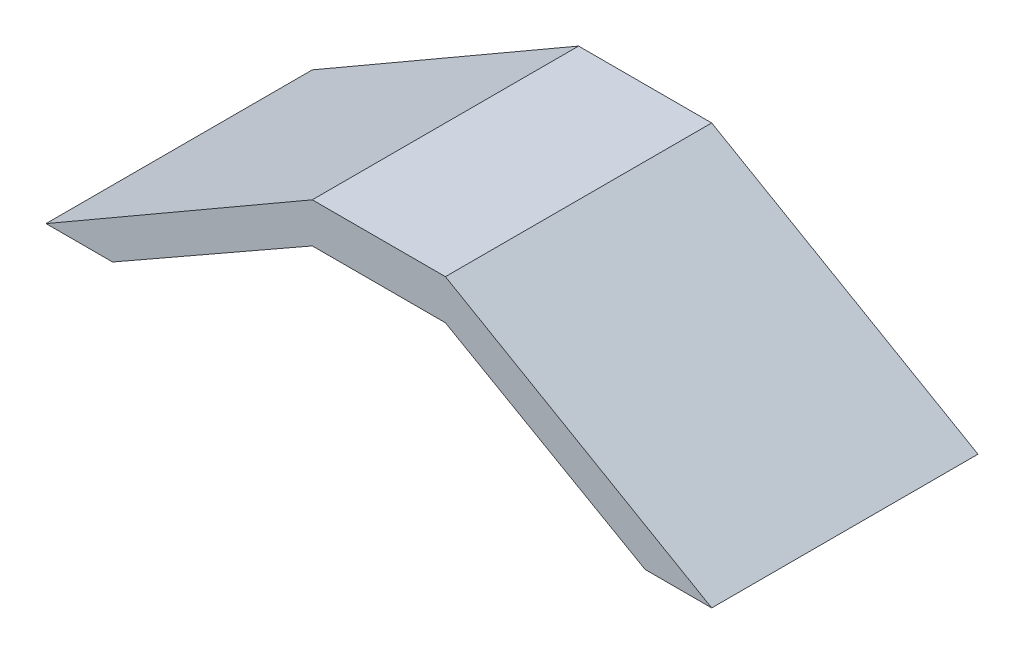
ISO-10303-21;
HEADER;
FILE_DESCRIPTION(('STEP AP214'),'2;1');
FILE_NAME('part.step','',(''),(''),'','','');
FILE_SCHEMA(('AUTOMOTIVE_DESIGN { 1 0 10303 214 1 1 1 1 }'));
ENDSEC;
DATA;
#1=APPLICATION_CONTEXT('core data for automotive mechanical design processes');
#2=APPLICATION_PROTOCOL_DEFINITION('international standard','automotive_design',2000,#1);
#3=PRODUCT_CONTEXT('',#1,'mechanical');
#4=PRODUCT('Part','Part','',(#3));
#5=PRODUCT_RELATED_PRODUCT_CATEGORY('part','',(#4));
#6=PRODUCT_DEFINITION_FORMATION('','',#4);
#7=PRODUCT_DEFINITION_CONTEXT('part definition',#1,'design');
#8=PRODUCT_DEFINITION('design','',#6,#7);
#9=PRODUCT_DEFINITION_SHAPE('','',#8);
#10=(LENGTH_UNIT() NAMED_UNIT(*) SI_UNIT(.MILLI.,.METRE.));
#11=(NAMED_UNIT(*) PLANE_ANGLE_UNIT() SI_UNIT($,.RADIAN.));
#12=(NAMED_UNIT(*) SI_UNIT($,.STERADIAN.) SOLID_ANGLE_UNIT());
#13=UNCERTAINTY_MEASURE_WITH_UNIT(LENGTH_MEASURE(1.E-05),#10,'distance_accuracy_value','');
#14=(GEOMETRIC_REPRESENTATION_CONTEXT(3) GLOBAL_UNCERTAINTY_ASSIGNED_CONTEXT((#13)) GLOBAL_UNIT_ASSIGNED_CONTEXT((#10,
#11,#12)) REPRESENTATION_CONTEXT('',''));
#15=CARTESIAN_POINT('',(0.,0.,0.));
#16=DIRECTION('',(0.,0.,1.));
#17=DIRECTION('',(1.,0.,0.));
#18=AXIS2_PLACEMENT_3D('',#15,#16,#17);
#19=CARTESIAN_POINT('',(0.,0.,-2000.));
#20=DIRECTION('',(0.,1.,0.));
#21=DIRECTION('',(-1.,0.,0.));
#22=AXIS2_PLACEMENT_3D('',#19,#20,#21);
#23=PLANE('',#22);
#24=DIRECTION('',(-1.,0.,0.));
#25=VECTOR('',#24,1.);
#26=CARTESIAN_POINT('',(0.,0.,0.));
#27=LINE('',#26,#25);
#28=CARTESIAN_POINT('',(-2500.,6.87163088490546E-13,0.));
#29=VERTEX_POINT('',#28);
#30=CARTESIAN_POINT('',(-3000.,8.49830834647197E-13,0.));
#31=VERTEX_POINT('',#30);
#32=EDGE_CURVE('E130',#29,#31,#27,.T.);
#33=ORIENTED_EDGE('',*,*,#32,.T.);
#34=DIRECTION('',(0.,0.,1.));
#35=VECTOR('',#34,1.);
#36=CARTESIAN_POINT('',(-3000.,8.49830834647197E-13,-2000.));
#37=LINE('',#36,#35);
#38=CARTESIAN_POINT('',(-3000.,8.49830834647197E-13,-2000.));
#39=VERTEX_POINT('',#38);
#40=EDGE_CURVE('E11',#39,#31,#37,.T.);
#41=ORIENTED_EDGE('',*,*,#40,.F.);
#42=DIRECTION('',(-1.,0.,0.));
#43=VECTOR('',#42,1.);
#44=CARTESIAN_POINT('',(0.,0.,-2000.));
#45=LINE('',#44,#43);
#46=CARTESIAN_POINT('',(-2500.,6.87163088490546E-13,-2000.));
#47=VERTEX_POINT('',#46);
#48=EDGE_CURVE('E148',#47,#39,#45,.T.);
#49=ORIENTED_EDGE('',*,*,#48,.F.);
#50=DIRECTION('',(0.,0.,1.));
#51=VECTOR('',#50,1.);
#52=CARTESIAN_POINT('',(-2500.,6.87163088490546E-13,-2000.));
#53=LINE('',#52,#51);
#54=EDGE_CURVE('E36',#47,#29,#53,.T.);
#55=ORIENTED_EDGE('',*,*,#54,.T.);
#56=EDGE_LOOP('',(#33,#41,#49,#55));
#57=FACE_BOUND('',#56,.T.);
#58=ADVANCED_FACE('F33',(#57),#23,.F.);
#59=CARTESIAN_POINT('',(-749.999999999984,1299.03810567665,-2000.));
#60=DIRECTION('',(0.499999999999995,-0.866025403784442,0.));
#61=DIRECTION('',(0.866025403784442,0.499999999999995,0.));
#62=AXIS2_PLACEMENT_3D('',#59,#60,#61);
#63=PLANE('',#62);
#64=DIRECTION('',(0.866025403784442,0.499999999999995,0.));
#65=VECTOR('',#64,1.);
#66=CARTESIAN_POINT('',(-749.999999999984,1299.03810567665,0.));
#67=LINE('',#66,#65);
#68=CARTESIAN_POINT('',(-1000.,1154.70053837923,0.));
#69=VERTEX_POINT('',#68);
#70=EDGE_CURVE('E84',#31,#69,#67,.T.);
#71=ORIENTED_EDGE('',*,*,#70,.T.);
#72=DIRECTION('',(0.,0.,1.));
#73=VECTOR('',#72,1.);
#74=CARTESIAN_POINT('',(-1000.,1154.70053837923,-2000.));
#75=LINE('',#74,#73);
#76=CARTESIAN_POINT('',(-1000.,1154.70053837923,-2000.));
#77=VERTEX_POINT('',#76);
#78=EDGE_CURVE('E42',#77,#69,#75,.T.);
#79=ORIENTED_EDGE('',*,*,#78,.F.);
#80=DIRECTION('',(0.866025403784442,0.499999999999995,0.));
#81=VECTOR('',#80,1.);
#82=CARTESIAN_POINT('',(-749.999999999984,1299.03810567665,-2000.));
#83=LINE('',#82,#81);
#84=EDGE_CURVE('E50',#39,#77,#83,.T.);
#85=ORIENTED_EDGE('',*,*,#84,.F.);
#86=ORIENTED_EDGE('',*,*,#40,.T.);
#87=EDGE_LOOP('',(#71,#79,#85,#86));
#88=FACE_BOUND('',#87,.T.);
#89=ADVANCED_FACE('F173',(#88),#63,.F.);
#90=CARTESIAN_POINT('',(-7.69185074553415E-13,1154.70053837924,-2000.));
#91=DIRECTION('',(0.,1.,0.));
#92=DIRECTION('',(-1.,0.,0.));
#93=AXIS2_PLACEMENT_3D('',#90,#91,#92);
#94=PLANE('',#93);
#95=DIRECTION('',(-1.,0.,0.));
#96=VECTOR('',#95,1.);
#97=CARTESIAN_POINT('',(-7.69185074553415E-13,1154.70053837924,0.));
#98=LINE('',#97,#96);
#99=CARTESIAN_POINT('',(0.,1154.70053837924,0.));
#100=VERTEX_POINT('',#99);
#101=EDGE_CURVE('E108',#100,#69,#98,.T.);
#102=ORIENTED_EDGE('',*,*,#101,.F.);
#103=DIRECTION('',(0.,0.,1.));
#104=VECTOR('',#103,1.);
#105=CARTESIAN_POINT('',(0.,1154.70053837924,-2000.));
#106=LINE('',#105,#104);
#107=CARTESIAN_POINT('',(0.,1154.70053837924,-2000.));
#108=VERTEX_POINT('',#107);
#109=EDGE_CURVE('E104',#108,#100,#106,.T.);
#110=ORIENTED_EDGE('',*,*,#109,.F.);
#111=DIRECTION('',(-1.,0.,0.));
#112=VECTOR('',#111,1.);
#113=CARTESIAN_POINT('',(-7.69185074553415E-13,1154.70053837924,-2000.));
#114=LINE('',#113,#112);
#115=EDGE_CURVE('E107',#108,#77,#114,.T.);
#116=ORIENTED_EDGE('',*,*,#115,.T.);
#117=ORIENTED_EDGE('',*,*,#78,.T.);
#118=EDGE_LOOP('',(#102,#110,#116,#117));
#119=FACE_BOUND('',#118,.T.);
#120=ADVANCED_FACE('F106',(#119),#94,.T.);
#121=CARTESIAN_POINT('',(499.99999999999,866.025403784433,-2000.));
#122=DIRECTION('',(0.499999999999995,0.866025403784442,0.));
#123=DIRECTION('',(-0.866025403784442,0.499999999999995,0.));
#124=AXIS2_PLACEMENT_3D('',#121,#122,#123);
#125=PLANE('',#124);
#126=DIRECTION('',(-0.866025403784442,0.499999999999995,0.));
#127=VECTOR('',#126,1.);
#128=CARTESIAN_POINT('',(499.99999999999,866.025403784433,0.));
#129=LINE('',#128,#127);
#130=CARTESIAN_POINT('',(2000.,0.,0.));
#131=VERTEX_POINT('',#130);
#132=EDGE_CURVE('E145',#131,#100,#129,.T.);
#133=ORIENTED_EDGE('',*,*,#132,.F.);
#134=DIRECTION('',(0.,0.,1.));
#135=VECTOR('',#134,1.);
#136=CARTESIAN_POINT('',(2000.,0.,-2000.));
#137=LINE('',#136,#135);
#138=CARTESIAN_POINT('',(2000.,0.,-2000.));
#139=VERTEX_POINT('',#138);
#140=EDGE_CURVE('E113',#139,#131,#137,.T.);
#141=ORIENTED_EDGE('',*,*,#140,.F.);
#142=DIRECTION('',(-0.866025403784442,0.499999999999995,0.));
#143=VECTOR('',#142,1.);
#144=CARTESIAN_POINT('',(499.99999999999,866.025403784433,-2000.));
#145=LINE('',#144,#143);
#146=EDGE_CURVE('E119',#139,#108,#145,.T.);
#147=ORIENTED_EDGE('',*,*,#146,.T.);
#148=ORIENTED_EDGE('',*,*,#109,.T.);
#149=EDGE_LOOP('',(#133,#141,#147,#148));
#150=FACE_BOUND('',#149,.T.);
#151=ADVANCED_FACE('F122',(#150),#125,.T.);
#152=CARTESIAN_POINT('',(0.,0.,-2000.));
#153=DIRECTION('',(0.,-1.,0.));
#154=DIRECTION('',(0.,0.,-1.));
#155=AXIS2_PLACEMENT_3D('',#152,#153,#154);
#156=PLANE('',#155);
#157=DIRECTION('',(1.,0.,0.));
#158=VECTOR('',#157,1.);
#159=CARTESIAN_POINT('',(0.,0.,0.));
#160=LINE('',#159,#158);
#161=CARTESIAN_POINT('',(1500.,0.,0.));
#162=VERTEX_POINT('',#161);
#163=EDGE_CURVE('E142',#162,#131,#160,.T.);
#164=ORIENTED_EDGE('',*,*,#163,.F.);
#165=DIRECTION('',(0.,0.,1.));
#166=VECTOR('',#165,1.);
#167=CARTESIAN_POINT('',(1500.,0.,-2000.));
#168=LINE('',#167,#166);
#169=CARTESIAN_POINT('',(1500.,0.,-2000.));
#170=VERTEX_POINT('',#169);
#171=EDGE_CURVE('E152',#170,#162,#168,.T.);
#172=ORIENTED_EDGE('',*,*,#171,.F.);
#173=DIRECTION('',(1.,0.,0.));
#174=VECTOR('',#173,1.);
#175=CARTESIAN_POINT('',(0.,0.,-2000.));
#176=LINE('',#175,#174);
#177=EDGE_CURVE('E123',#170,#139,#176,.T.);
#178=ORIENTED_EDGE('',*,*,#177,.T.);
#179=ORIENTED_EDGE('',*,*,#140,.T.);
#180=EDGE_LOOP('',(#164,#172,#178,#179));
#181=FACE_BOUND('',#180,.T.);
#182=ADVANCED_FACE('F186',(#181),#156,.T.);
#183=CARTESIAN_POINT('',(367.644600667663,645.216512963989,-2000.));
#184=DIRECTION('',(-0.495072116408417,-0.868851885855634,0.));
#185=DIRECTION('',(0.868851885855634,-0.495072116408417,0.));
#186=AXIS2_PLACEMENT_3D('',#183,#184,#185);
#187=PLANE('',#186);
#188=DIRECTION('',(0.868851885855634,-0.495072116408417,0.));
#189=VECTOR('',#188,1.);
#190=CARTESIAN_POINT('',(367.644600667663,645.216512963989,0.));
#191=LINE('',#190,#189);
#192=CARTESIAN_POINT('',(0.,854.700538379236,0.));
#193=VERTEX_POINT('',#192);
#194=EDGE_CURVE('E139',#193,#162,#191,.T.);
#195=ORIENTED_EDGE('',*,*,#194,.F.);
#196=DIRECTION('',(0.,0.,1.));
#197=VECTOR('',#196,1.);
#198=CARTESIAN_POINT('',(0.,854.700538379236,-2000.));
#199=LINE('',#198,#197);
#200=CARTESIAN_POINT('',(0.,854.700538379236,-2000.));
#201=VERTEX_POINT('',#200);
#202=EDGE_CURVE('E154',#201,#193,#199,.T.);
#203=ORIENTED_EDGE('',*,*,#202,.F.);
#204=DIRECTION('',(0.868851885855634,-0.495072116408417,0.));
#205=VECTOR('',#204,1.);
#206=CARTESIAN_POINT('',(367.644600667663,645.216512963989,-2000.));
#207=LINE('',#206,#205);
#208=EDGE_CURVE('E125',#201,#170,#207,.T.);
#209=ORIENTED_EDGE('',*,*,#208,.T.);
#210=ORIENTED_EDGE('',*,*,#171,.T.);
#211=EDGE_LOOP('',(#195,#203,#209,#210));
#212=FACE_BOUND('',#211,.T.);
#213=ADVANCED_FACE('F169',(#212),#187,.T.);
#214=CARTESIAN_POINT('',(0.,854.700538379236,-2000.));
#215=DIRECTION('',(0.,-1.,0.));
#216=DIRECTION('',(0.,0.,-1.));
#217=AXIS2_PLACEMENT_3D('',#214,#215,#216);
#218=PLANE('',#217);
#219=DIRECTION('',(1.,0.,0.));
#220=VECTOR('',#219,1.);
#221=CARTESIAN_POINT('',(0.,854.700538379236,0.));
#222=LINE('',#221,#220);
#223=CARTESIAN_POINT('',(-1000.,854.700538379236,0.));
#224=VERTEX_POINT('',#223);
#225=EDGE_CURVE('E136',#224,#193,#222,.T.);
#226=ORIENTED_EDGE('',*,*,#225,.F.);
#227=DIRECTION('',(0.,0.,1.));
#228=VECTOR('',#227,1.);
#229=CARTESIAN_POINT('',(-1000.,854.700538379236,-2000.));
#230=LINE('',#229,#228);
#231=CARTESIAN_POINT('',(-1000.,854.700538379236,-2000.));
#232=VERTEX_POINT('',#231);
#233=EDGE_CURVE('E155',#232,#224,#230,.T.);
#234=ORIENTED_EDGE('',*,*,#233,.F.);
#235=DIRECTION('',(1.,0.,0.));
#236=VECTOR('',#235,1.);
#237=CARTESIAN_POINT('',(0.,854.700538379236,-2000.));
#238=LINE('',#237,#236);
#239=EDGE_CURVE('E200',#232,#201,#238,.T.);
#240=ORIENTED_EDGE('',*,*,#239,.T.);
#241=ORIENTED_EDGE('',*,*,#202,.T.);
#242=EDGE_LOOP('',(#226,#234,#240,#241));
#243=FACE_BOUND('',#242,.T.);
#244=ADVANCED_FACE('F163',(#243),#218,.T.);
#245=CARTESIAN_POINT('',(-612.741001112772,1075.36085493998,-2000.));
#246=DIRECTION('',(0.495072116408417,-0.868851885855634,0.));
#247=DIRECTION('',(0.868851885855634,0.495072116408417,0.));
#248=AXIS2_PLACEMENT_3D('',#245,#246,#247);
#249=PLANE('',#248);
#250=DIRECTION('',(0.868851885855634,0.495072116408417,0.));
#251=VECTOR('',#250,1.);
#252=CARTESIAN_POINT('',(-612.741001112772,1075.36085493998,0.));
#253=LINE('',#252,#251);
#254=EDGE_CURVE('E133',#29,#224,#253,.T.);
#255=ORIENTED_EDGE('',*,*,#254,.F.);
#256=ORIENTED_EDGE('',*,*,#54,.F.);
#257=DIRECTION('',(0.868851885855634,0.495072116408417,0.));
#258=VECTOR('',#257,1.);
#259=CARTESIAN_POINT('',(-612.741001112772,1075.36085493998,-2000.));
#260=LINE('',#259,#258);
#261=EDGE_CURVE('E201',#47,#232,#260,.T.);
#262=ORIENTED_EDGE('',*,*,#261,.T.);
#263=ORIENTED_EDGE('',*,*,#233,.T.);
#264=EDGE_LOOP('',(#255,#256,#262,#263));
#265=FACE_BOUND('',#264,.T.);
#266=ADVANCED_FACE('F161',(#265),#249,.T.);
#267=CARTESIAN_POINT('',(0.,0.,-2000.));
#268=DIRECTION('',(0.,0.,1.));
#269=DIRECTION('',(1.,0.,0.));
#270=AXIS2_PLACEMENT_3D('',#267,#268,#269);
#271=PLANE('',#270);
#272=ORIENTED_EDGE('',*,*,#48,.T.);
#273=ORIENTED_EDGE('',*,*,#84,.T.);
#274=ORIENTED_EDGE('',*,*,#115,.F.);
#275=ORIENTED_EDGE('',*,*,#146,.F.);
#276=ORIENTED_EDGE('',*,*,#177,.F.);
#277=ORIENTED_EDGE('',*,*,#208,.F.);
#278=ORIENTED_EDGE('',*,*,#239,.F.);
#279=ORIENTED_EDGE('',*,*,#261,.F.);
#280=EDGE_LOOP('',(#272,#273,#274,#275,#276,#277,#278,#279));
#281=FACE_BOUND('',#280,.T.);
#282=ADVANCED_FACE('F117',(#281),#271,.F.);
#283=CARTESIAN_POINT('',(0.,0.,0.));
#284=DIRECTION('',(0.,0.,1.));
#285=DIRECTION('',(1.,0.,0.));
#286=AXIS2_PLACEMENT_3D('',#283,#284,#285);
#287=PLANE('',#286);
#288=ORIENTED_EDGE('',*,*,#32,.F.);
#289=ORIENTED_EDGE('',*,*,#254,.T.);
#290=ORIENTED_EDGE('',*,*,#225,.T.);
#291=ORIENTED_EDGE('',*,*,#194,.T.);
#292=ORIENTED_EDGE('',*,*,#163,.T.);
#293=ORIENTED_EDGE('',*,*,#132,.T.);
#294=ORIENTED_EDGE('',*,*,#101,.T.);
#295=ORIENTED_EDGE('',*,*,#70,.F.);
#296=EDGE_LOOP('',(#288,#289,#290,#291,#292,#293,#294,#295));
#297=FACE_BOUND('',#296,.T.);
#298=ADVANCED_FACE('F160',(#297),#287,.T.);
#299=CLOSED_SHELL('',(#58,#89,#120,#151,#182,#213,#244,#266,#282,#298));
#300=MANIFOLD_SOLID_BREP('B2',#299);
#301=ADVANCED_BREP_SHAPE_REPRESENTATION('',(#18,#300),#14);
#302=SHAPE_DEFINITION_REPRESENTATION(#9,#301);
ENDSEC;
END-ISO-10303-21;
